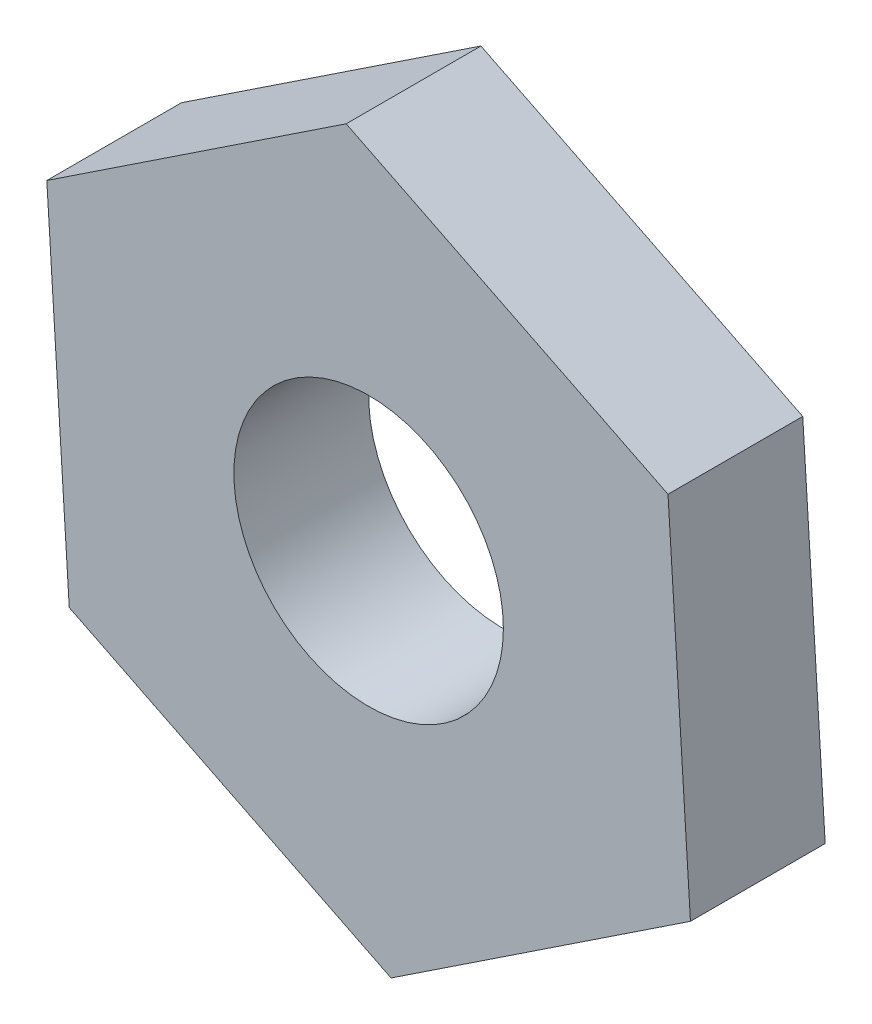
ISO-10303-21;
HEADER;
FILE_DESCRIPTION(('STEP AP214'),'2;1');
FILE_NAME('part.step','',(''),(''),'','','');
FILE_SCHEMA(('AUTOMOTIVE_DESIGN { 1 0 10303 214 1 1 1 1 }'));
ENDSEC;
DATA;
#1=APPLICATION_CONTEXT('core data for automotive mechanical design processes');
#2=APPLICATION_PROTOCOL_DEFINITION('international standard','automotive_design',2000,#1);
#3=PRODUCT_CONTEXT('',#1,'mechanical');
#4=PRODUCT('Part','Part','',(#3));
#5=PRODUCT_RELATED_PRODUCT_CATEGORY('part','',(#4));
#6=PRODUCT_DEFINITION_FORMATION('','',#4);
#7=PRODUCT_DEFINITION_CONTEXT('part definition',#1,'design');
#8=PRODUCT_DEFINITION('design','',#6,#7);
#9=PRODUCT_DEFINITION_SHAPE('','',#8);
#10=(LENGTH_UNIT() NAMED_UNIT(*) SI_UNIT(.MILLI.,.METRE.));
#11=(NAMED_UNIT(*) PLANE_ANGLE_UNIT() SI_UNIT($,.RADIAN.));
#12=(NAMED_UNIT(*) SI_UNIT($,.STERADIAN.) SOLID_ANGLE_UNIT());
#13=UNCERTAINTY_MEASURE_WITH_UNIT(LENGTH_MEASURE(1.E-05),#10,'distance_accuracy_value','');
#14=(GEOMETRIC_REPRESENTATION_CONTEXT(3) GLOBAL_UNCERTAINTY_ASSIGNED_CONTEXT((#13)) GLOBAL_UNIT_ASSIGNED_CONTEXT((#10,
#11,#12)) REPRESENTATION_CONTEXT('',''));
#15=CARTESIAN_POINT('',(0.,0.,0.));
#16=DIRECTION('',(0.,0.,1.));
#17=DIRECTION('',(1.,0.,0.));
#18=AXIS2_PLACEMENT_3D('',#15,#16,#17);
#19=CARTESIAN_POINT('',(-3.5822742322948,1.77969416603996,1.5));
#20=DIRECTION('',(0.99804689287742,0.0624691893474596,0.));
#21=DIRECTION('',(-0.0624691893474596,0.99804689287742,0.));
#22=AXIS2_PLACEMENT_3D('',#19,#20,#21);
#23=PLANE('',#22);
#24=DIRECTION('',(0.0624691893474596,-0.998046892877419,0.));
#25=VECTOR('',#24,1.);
#26=CARTESIAN_POINT('',(-3.5822742322948,1.77969416603996,0.));
#27=LINE('',#26,#25);
#28=CARTESIAN_POINT('',(-3.5822742322948,1.77969416603996,0.));
#29=VERTEX_POINT('',#28);
#30=CARTESIAN_POINT('',(-3.33239747490497,-2.21249340546972,0.));
#31=VERTEX_POINT('',#30);
#32=EDGE_CURVE('E123',#29,#31,#27,.T.);
#33=ORIENTED_EDGE('',*,*,#32,.T.);
#34=DIRECTION('',(0.,0.,-1.));
#35=VECTOR('',#34,1.);
#36=CARTESIAN_POINT('',(-3.33239747490497,-2.21249340546972,1.5));
#37=LINE('',#36,#35);
#38=CARTESIAN_POINT('',(-3.33239747490497,-2.21249340546972,1.5));
#39=VERTEX_POINT('',#38);
#40=EDGE_CURVE('E11',#39,#31,#37,.T.);
#41=ORIENTED_EDGE('',*,*,#40,.F.);
#42=DIRECTION('',(0.0624691893474596,-0.998046892877419,0.));
#43=VECTOR('',#42,1.);
#44=CARTESIAN_POINT('',(-3.5822742322948,1.77969416603996,1.5));
#45=LINE('',#44,#43);
#46=CARTESIAN_POINT('',(-3.5822742322948,1.77969416603996,1.5));
#47=VERTEX_POINT('',#46);
#48=EDGE_CURVE('E134',#47,#39,#45,.T.);
#49=ORIENTED_EDGE('',*,*,#48,.F.);
#50=DIRECTION('',(0.,0.,-1.));
#51=VECTOR('',#50,1.);
#52=CARTESIAN_POINT('',(-3.5822742322948,1.77969416603996,1.5));
#53=LINE('',#52,#51);
#54=EDGE_CURVE('E119',#47,#29,#53,.T.);
#55=ORIENTED_EDGE('',*,*,#54,.T.);
#56=EDGE_LOOP('',(#33,#41,#49,#55));
#57=FACE_BOUND('',#56,.T.);
#58=ADVANCED_FACE('F39',(#57),#23,.F.);
#59=CARTESIAN_POINT('',(-3.33239747490497,-2.21249340546972,1.5));
#60=DIRECTION('',(0.44492354150999,0.895568558073701,0.));
#61=DIRECTION('',(-0.895568558073701,0.44492354150999,0.));
#62=AXIS2_PLACEMENT_3D('',#59,#60,#61);
#63=PLANE('',#62);
#64=DIRECTION('',(0.895568558073701,-0.44492354150999,0.));
#65=VECTOR('',#64,1.);
#66=CARTESIAN_POINT('',(-3.33239747490497,-2.21249340546972,0.));
#67=LINE('',#66,#65);
#68=CARTESIAN_POINT('',(0.249876757389834,-3.99218757150967,0.));
#69=VERTEX_POINT('',#68);
#70=EDGE_CURVE('E126',#31,#69,#67,.T.);
#71=ORIENTED_EDGE('',*,*,#70,.T.);
#72=DIRECTION('',(0.,0.,-1.));
#73=VECTOR('',#72,1.);
#74=CARTESIAN_POINT('',(0.249876757389834,-3.99218757150967,1.5));
#75=LINE('',#74,#73);
#76=CARTESIAN_POINT('',(0.249876757389834,-3.99218757150967,1.5));
#77=VERTEX_POINT('',#76);
#78=EDGE_CURVE('E47',#77,#69,#75,.T.);
#79=ORIENTED_EDGE('',*,*,#78,.F.);
#80=DIRECTION('',(0.895568558073701,-0.44492354150999,0.));
#81=VECTOR('',#80,1.);
#82=CARTESIAN_POINT('',(-3.33239747490497,-2.21249340546972,1.5));
#83=LINE('',#82,#81);
#84=EDGE_CURVE('E92',#39,#77,#83,.T.);
#85=ORIENTED_EDGE('',*,*,#84,.F.);
#86=ORIENTED_EDGE('',*,*,#40,.T.);
#87=EDGE_LOOP('',(#71,#79,#85,#86));
#88=FACE_BOUND('',#87,.T.);
#89=ADVANCED_FACE('F159',(#88),#63,.F.);
#90=CARTESIAN_POINT('',(0.249876757389834,-3.99218757150967,1.5));
#91=DIRECTION('',(-0.55312335136743,0.833099368726242,0.));
#92=DIRECTION('',(-0.833099368726242,-0.55312335136743,0.));
#93=AXIS2_PLACEMENT_3D('',#90,#91,#92);
#94=PLANE('',#93);
#95=DIRECTION('',(0.833099368726242,0.55312335136743,0.));
#96=VECTOR('',#95,1.);
#97=CARTESIAN_POINT('',(0.249876757389834,-3.99218757150967,0.));
#98=LINE('',#97,#96);
#99=CARTESIAN_POINT('',(3.5822742322948,-1.77969416603995,0.));
#100=VERTEX_POINT('',#99);
#101=EDGE_CURVE('E129',#69,#100,#98,.T.);
#102=ORIENTED_EDGE('',*,*,#101,.T.);
#103=DIRECTION('',(0.,0.,-1.));
#104=VECTOR('',#103,1.);
#105=CARTESIAN_POINT('',(3.5822742322948,-1.77969416603995,1.5));
#106=LINE('',#105,#104);
#107=CARTESIAN_POINT('',(3.5822742322948,-1.77969416603995,1.5));
#108=VERTEX_POINT('',#107);
#109=EDGE_CURVE('E114',#108,#100,#106,.T.);
#110=ORIENTED_EDGE('',*,*,#109,.F.);
#111=DIRECTION('',(0.833099368726242,0.55312335136743,0.));
#112=VECTOR('',#111,1.);
#113=CARTESIAN_POINT('',(0.249876757389834,-3.99218757150967,1.5));
#114=LINE('',#113,#112);
#115=EDGE_CURVE('E105',#77,#108,#114,.T.);
#116=ORIENTED_EDGE('',*,*,#115,.F.);
#117=ORIENTED_EDGE('',*,*,#78,.T.);
#118=EDGE_LOOP('',(#102,#110,#116,#117));
#119=FACE_BOUND('',#118,.T.);
#120=ADVANCED_FACE('F140',(#119),#94,.F.);
#121=CARTESIAN_POINT('',(3.5822742322948,-1.77969416603995,1.5));
#122=DIRECTION('',(-0.998046892877419,-0.0624691893474599,0.));
#123=DIRECTION('',(0.0624691893474599,-0.99804689287742,0.));
#124=AXIS2_PLACEMENT_3D('',#121,#122,#123);
#125=PLANE('',#124);
#126=DIRECTION('',(-0.0624691893474599,0.998046892877419,0.));
#127=VECTOR('',#126,1.);
#128=CARTESIAN_POINT('',(3.5822742322948,-1.77969416603995,0.));
#129=LINE('',#128,#127);
#130=CARTESIAN_POINT('',(3.33239747490496,2.21249340546972,0.));
#131=VERTEX_POINT('',#130);
#132=EDGE_CURVE('E113',#100,#131,#129,.T.);
#133=ORIENTED_EDGE('',*,*,#132,.T.);
#134=DIRECTION('',(0.,0.,-1.));
#135=VECTOR('',#134,1.);
#136=CARTESIAN_POINT('',(3.33239747490496,2.21249340546972,1.5));
#137=LINE('',#136,#135);
#138=CARTESIAN_POINT('',(3.33239747490496,2.21249340546972,1.5));
#139=VERTEX_POINT('',#138);
#140=EDGE_CURVE('E110',#139,#131,#137,.T.);
#141=ORIENTED_EDGE('',*,*,#140,.F.);
#142=DIRECTION('',(-0.0624691893474599,0.998046892877419,0.));
#143=VECTOR('',#142,1.);
#144=CARTESIAN_POINT('',(3.5822742322948,-1.77969416603995,1.5));
#145=LINE('',#144,#143);
#146=EDGE_CURVE('E99',#108,#139,#145,.T.);
#147=ORIENTED_EDGE('',*,*,#146,.F.);
#148=ORIENTED_EDGE('',*,*,#109,.T.);
#149=EDGE_LOOP('',(#133,#141,#147,#148));
#150=FACE_BOUND('',#149,.T.);
#151=ADVANCED_FACE('F111',(#150),#125,.F.);
#152=CARTESIAN_POINT('',(3.33239747490496,2.21249340546972,1.5));
#153=DIRECTION('',(-0.44492354150999,-0.895568558073701,0.));
#154=DIRECTION('',(0.895568558073701,-0.44492354150999,0.));
#155=AXIS2_PLACEMENT_3D('',#152,#153,#154);
#156=PLANE('',#155);
#157=DIRECTION('',(-0.895568558073701,0.44492354150999,0.));
#158=VECTOR('',#157,1.);
#159=CARTESIAN_POINT('',(3.33239747490496,2.21249340546972,0.));
#160=LINE('',#159,#158);
#161=CARTESIAN_POINT('',(-0.249876757389836,3.99218757150968,0.));
#162=VERTEX_POINT('',#161);
#163=EDGE_CURVE('E78',#131,#162,#160,.T.);
#164=ORIENTED_EDGE('',*,*,#163,.T.);
#165=DIRECTION('',(0.,0.,-1.));
#166=VECTOR('',#165,1.);
#167=CARTESIAN_POINT('',(-0.249876757389836,3.99218757150968,1.5));
#168=LINE('',#167,#166);
#169=CARTESIAN_POINT('',(-0.249876757389836,3.99218757150968,1.5));
#170=VERTEX_POINT('',#169);
#171=EDGE_CURVE('E115',#170,#162,#168,.T.);
#172=ORIENTED_EDGE('',*,*,#171,.F.);
#173=DIRECTION('',(-0.895568558073701,0.44492354150999,0.));
#174=VECTOR('',#173,1.);
#175=CARTESIAN_POINT('',(3.33239747490496,2.21249340546972,1.5));
#176=LINE('',#175,#174);
#177=EDGE_CURVE('E103',#139,#170,#176,.T.);
#178=ORIENTED_EDGE('',*,*,#177,.F.);
#179=ORIENTED_EDGE('',*,*,#140,.T.);
#180=EDGE_LOOP('',(#164,#172,#178,#179));
#181=FACE_BOUND('',#180,.T.);
#182=ADVANCED_FACE('F117',(#181),#156,.F.);
#183=CARTESIAN_POINT('',(-0.249876757389836,3.99218757150968,1.5));
#184=DIRECTION('',(0.55312335136743,-0.833099368726242,0.));
#185=DIRECTION('',(0.833099368726242,0.55312335136743,0.));
#186=AXIS2_PLACEMENT_3D('',#183,#184,#185);
#187=PLANE('',#186);
#188=DIRECTION('',(-0.833099368726242,-0.55312335136743,0.));
#189=VECTOR('',#188,1.);
#190=CARTESIAN_POINT('',(-0.249876757389836,3.99218757150968,0.));
#191=LINE('',#190,#189);
#192=EDGE_CURVE('E84',#162,#29,#191,.T.);
#193=ORIENTED_EDGE('',*,*,#192,.T.);
#194=ORIENTED_EDGE('',*,*,#54,.F.);
#195=DIRECTION('',(-0.833099368726242,-0.55312335136743,0.));
#196=VECTOR('',#195,1.);
#197=CARTESIAN_POINT('',(-0.249876757389836,3.99218757150968,1.5));
#198=LINE('',#197,#196);
#199=EDGE_CURVE('E55',#170,#47,#198,.T.);
#200=ORIENTED_EDGE('',*,*,#199,.F.);
#201=ORIENTED_EDGE('',*,*,#171,.T.);
#202=EDGE_LOOP('',(#193,#194,#200,#201));
#203=FACE_BOUND('',#202,.T.);
#204=ADVANCED_FACE('F147',(#203),#187,.F.);
#205=CARTESIAN_POINT('',(0.,0.,1.5));
#206=DIRECTION('',(0.,0.,1.));
#207=DIRECTION('',(1.,0.,0.));
#208=AXIS2_PLACEMENT_3D('',#205,#206,#207);
#209=PLANE('',#208);
#210=CARTESIAN_POINT('',(0.,0.,1.5));
#211=DIRECTION('',(0.,0.,1.));
#212=DIRECTION('',(1.,0.,0.));
#213=AXIS2_PLACEMENT_3D('',#210,#211,#212);
#214=CIRCLE('',#213,1.5);
#215=CARTESIAN_POINT('',(1.5,0.,1.5));
#216=VERTEX_POINT('',#215);
#217=EDGE_CURVE('E204',#216,#216,#214,.T.);
#218=ORIENTED_EDGE('',*,*,#217,.F.);
#219=EDGE_LOOP('',(#218));
#220=FACE_BOUND('',#219,.T.);
#221=ORIENTED_EDGE('',*,*,#48,.T.);
#222=ORIENTED_EDGE('',*,*,#84,.T.);
#223=ORIENTED_EDGE('',*,*,#115,.T.);
#224=ORIENTED_EDGE('',*,*,#146,.T.);
#225=ORIENTED_EDGE('',*,*,#177,.T.);
#226=ORIENTED_EDGE('',*,*,#199,.T.);
#227=EDGE_LOOP('',(#221,#222,#223,#224,#225,#226));
#228=FACE_BOUND('',#227,.T.);
#229=ADVANCED_FACE('F101',(#220,#228),#209,.T.);
#230=CARTESIAN_POINT('',(0.,0.,0.));
#231=DIRECTION('',(0.,0.,1.));
#232=DIRECTION('',(1.,0.,0.));
#233=AXIS2_PLACEMENT_3D('',#230,#231,#232);
#234=PLANE('',#233);
#235=CARTESIAN_POINT('',(0.,0.,0.));
#236=DIRECTION('',(0.,0.,1.));
#237=DIRECTION('',(1.,0.,0.));
#238=AXIS2_PLACEMENT_3D('',#235,#236,#237);
#239=CIRCLE('',#238,1.5);
#240=CARTESIAN_POINT('',(1.5,0.,0.));
#241=VERTEX_POINT('',#240);
#242=EDGE_CURVE('E127',#241,#241,#239,.T.);
#243=ORIENTED_EDGE('',*,*,#242,.T.);
#244=EDGE_LOOP('',(#243));
#245=FACE_BOUND('',#244,.T.);
#246=ORIENTED_EDGE('',*,*,#32,.F.);
#247=ORIENTED_EDGE('',*,*,#192,.F.);
#248=ORIENTED_EDGE('',*,*,#163,.F.);
#249=ORIENTED_EDGE('',*,*,#132,.F.);
#250=ORIENTED_EDGE('',*,*,#101,.F.);
#251=ORIENTED_EDGE('',*,*,#70,.F.);
#252=EDGE_LOOP('',(#246,#247,#248,#249,#250,#251));
#253=FACE_BOUND('',#252,.T.);
#254=ADVANCED_FACE('F143',(#245,#253),#234,.F.);
#255=CARTESIAN_POINT('',(0.,0.,0.));
#256=DIRECTION('',(0.,0.,1.));
#257=DIRECTION('',(1.,0.,0.));
#258=AXIS2_PLACEMENT_3D('',#255,#256,#257);
#259=CYLINDRICAL_SURFACE('',#258,1.5);
#260=ORIENTED_EDGE('',*,*,#242,.F.);
#261=EDGE_LOOP('',(#260));
#262=FACE_BOUND('',#261,.T.);
#263=ORIENTED_EDGE('',*,*,#217,.T.);
#264=EDGE_LOOP('',(#263));
#265=FACE_BOUND('',#264,.T.);
#266=ADVANCED_FACE('F190',(#262,#265),#259,.F.);
#267=CLOSED_SHELL('',(#58,#89,#120,#151,#182,#204,#229,#254,#266));
#268=MANIFOLD_SOLID_BREP('B2',#267);
#269=ADVANCED_BREP_SHAPE_REPRESENTATION('',(#18,#268),#14);
#270=SHAPE_DEFINITION_REPRESENTATION(#9,#269);
ENDSEC;
END-ISO-10303-21;
